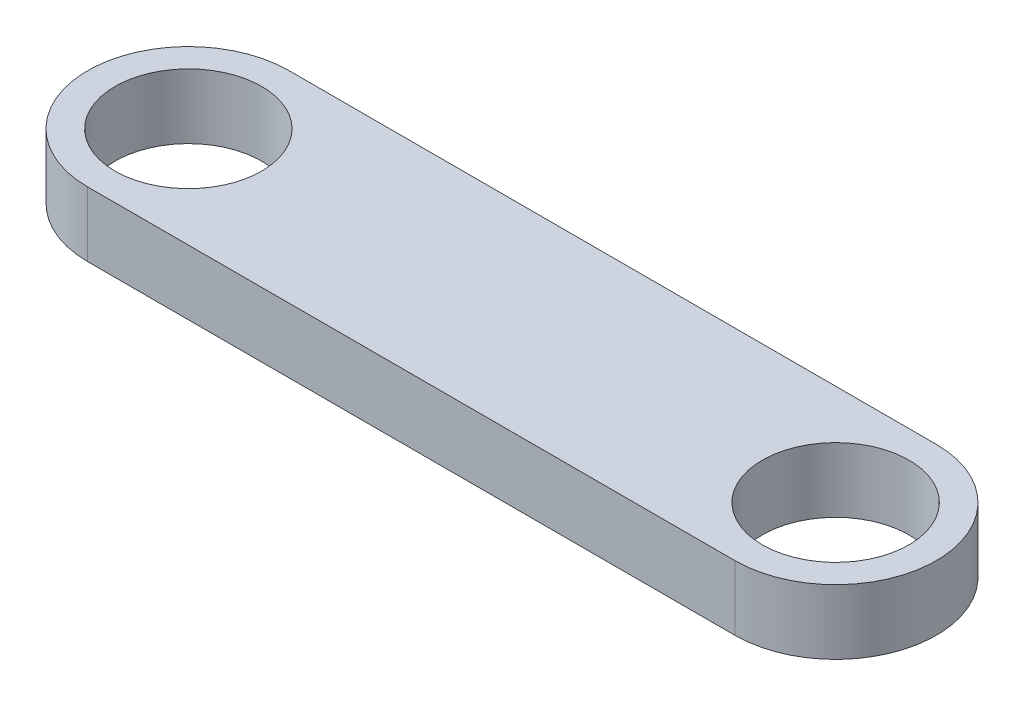
ISO-10303-21;
HEADER;
FILE_DESCRIPTION(('STEP AP214'),'2;1');
FILE_NAME('part.step','',(''),(''),'','','');
FILE_SCHEMA(('AUTOMOTIVE_DESIGN { 1 0 10303 214 1 1 1 1 }'));
ENDSEC;
DATA;
#1=APPLICATION_CONTEXT('core data for automotive mechanical design processes');
#2=APPLICATION_PROTOCOL_DEFINITION('international standard','automotive_design',2000,#1);
#3=PRODUCT_CONTEXT('',#1,'mechanical');
#4=PRODUCT('Part','Part','',(#3));
#5=PRODUCT_RELATED_PRODUCT_CATEGORY('part','',(#4));
#6=PRODUCT_DEFINITION_FORMATION('','',#4);
#7=PRODUCT_DEFINITION_CONTEXT('part definition',#1,'design');
#8=PRODUCT_DEFINITION('design','',#6,#7);
#9=PRODUCT_DEFINITION_SHAPE('','',#8);
#10=(LENGTH_UNIT() NAMED_UNIT(*) SI_UNIT(.MILLI.,.METRE.));
#11=(NAMED_UNIT(*) PLANE_ANGLE_UNIT() SI_UNIT($,.RADIAN.));
#12=(NAMED_UNIT(*) SI_UNIT($,.STERADIAN.) SOLID_ANGLE_UNIT());
#13=UNCERTAINTY_MEASURE_WITH_UNIT(LENGTH_MEASURE(1.E-05),#10,'distance_accuracy_value','');
#14=(GEOMETRIC_REPRESENTATION_CONTEXT(3) GLOBAL_UNCERTAINTY_ASSIGNED_CONTEXT((#13)) GLOBAL_UNIT_ASSIGNED_CONTEXT((#10,
#11,#12)) REPRESENTATION_CONTEXT('',''));
#15=CARTESIAN_POINT('',(0.,0.,0.));
#16=DIRECTION('',(0.,0.,1.));
#17=DIRECTION('',(1.,0.,0.));
#18=AXIS2_PLACEMENT_3D('',#15,#16,#17);
#19=CARTESIAN_POINT('',(22.5,4.5,0.));
#20=DIRECTION('',(0.,-1.,0.));
#21=DIRECTION('',(0.,0.,-1.));
#22=AXIS2_PLACEMENT_3D('',#19,#20,#21);
#23=CYLINDRICAL_SURFACE('',#22,7.);
#24=CARTESIAN_POINT('',(22.5,0.,0.));
#25=DIRECTION('',(0.,1.,0.));
#26=DIRECTION('',(0.,0.,1.));
#27=AXIS2_PLACEMENT_3D('',#24,#25,#26);
#28=CIRCLE('',#27,7.);
#29=CARTESIAN_POINT('',(22.5,0.,7.));
#30=VERTEX_POINT('',#29);
#31=CARTESIAN_POINT('',(22.5,0.,-7.));
#32=VERTEX_POINT('',#31);
#33=EDGE_CURVE('E111',#30,#32,#28,.T.);
#34=ORIENTED_EDGE('',*,*,#33,.T.);
#35=DIRECTION('',(0.,-1.,0.));
#36=VECTOR('',#35,1.);
#37=CARTESIAN_POINT('',(22.5,4.5,-7.));
#38=LINE('',#37,#36);
#39=CARTESIAN_POINT('',(22.5,4.5,-7.));
#40=VERTEX_POINT('',#39);
#41=EDGE_CURVE('E11',#40,#32,#38,.T.);
#42=ORIENTED_EDGE('',*,*,#41,.F.);
#43=CARTESIAN_POINT('',(22.5,4.5,0.));
#44=DIRECTION('',(0.,1.,0.));
#45=DIRECTION('',(0.,0.,1.));
#46=AXIS2_PLACEMENT_3D('',#43,#44,#45);
#47=CIRCLE('',#46,7.);
#48=CARTESIAN_POINT('',(22.5,4.5,7.));
#49=VERTEX_POINT('',#48);
#50=EDGE_CURVE('E82',#49,#40,#47,.T.);
#51=ORIENTED_EDGE('',*,*,#50,.F.);
#52=DIRECTION('',(0.,-1.,0.));
#53=VECTOR('',#52,1.);
#54=CARTESIAN_POINT('',(22.5,4.5,7.));
#55=LINE('',#54,#53);
#56=EDGE_CURVE('E110',#49,#30,#55,.T.);
#57=ORIENTED_EDGE('',*,*,#56,.T.);
#58=EDGE_LOOP('',(#34,#42,#51,#57));
#59=FACE_BOUND('',#58,.T.);
#60=ADVANCED_FACE('F40',(#59),#23,.T.);
#61=CARTESIAN_POINT('',(0.,4.5,-7.));
#62=DIRECTION('',(0.,0.,-1.));
#63=DIRECTION('',(-1.,0.,0.));
#64=AXIS2_PLACEMENT_3D('',#61,#62,#63);
#65=PLANE('',#64);
#66=DIRECTION('',(1.,0.,0.));
#67=VECTOR('',#66,1.);
#68=CARTESIAN_POINT('',(0.,0.,-7.));
#69=LINE('',#68,#67);
#70=CARTESIAN_POINT('',(-22.5,0.,-7.));
#71=VERTEX_POINT('',#70);
#72=EDGE_CURVE('E92',#71,#32,#69,.T.);
#73=ORIENTED_EDGE('',*,*,#72,.F.);
#74=DIRECTION('',(0.,-1.,0.));
#75=VECTOR('',#74,1.);
#76=CARTESIAN_POINT('',(-22.5,4.5,-7.));
#77=LINE('',#76,#75);
#78=CARTESIAN_POINT('',(-22.5,4.5,-7.));
#79=VERTEX_POINT('',#78);
#80=EDGE_CURVE('E48',#79,#71,#77,.T.);
#81=ORIENTED_EDGE('',*,*,#80,.F.);
#82=DIRECTION('',(1.,0.,0.));
#83=VECTOR('',#82,1.);
#84=CARTESIAN_POINT('',(0.,4.5,-7.));
#85=LINE('',#84,#83);
#86=EDGE_CURVE('E90',#79,#40,#85,.T.);
#87=ORIENTED_EDGE('',*,*,#86,.T.);
#88=ORIENTED_EDGE('',*,*,#41,.T.);
#89=EDGE_LOOP('',(#73,#81,#87,#88));
#90=FACE_BOUND('',#89,.T.);
#91=ADVANCED_FACE('F89',(#90),#65,.T.);
#92=CARTESIAN_POINT('',(-22.5,4.5,0.));
#93=DIRECTION('',(0.,-1.,0.));
#94=DIRECTION('',(0.,0.,-1.));
#95=AXIS2_PLACEMENT_3D('',#92,#93,#94);
#96=CYLINDRICAL_SURFACE('',#95,7.);
#97=CARTESIAN_POINT('',(-22.5,0.,0.));
#98=DIRECTION('',(0.,1.,0.));
#99=DIRECTION('',(0.,0.,1.));
#100=AXIS2_PLACEMENT_3D('',#97,#98,#99);
#101=CIRCLE('',#100,7.);
#102=CARTESIAN_POINT('',(-22.5,0.,7.));
#103=VERTEX_POINT('',#102);
#104=EDGE_CURVE('E71',#71,#103,#101,.T.);
#105=ORIENTED_EDGE('',*,*,#104,.T.);
#106=DIRECTION('',(0.,-1.,0.));
#107=VECTOR('',#106,1.);
#108=CARTESIAN_POINT('',(-22.5,4.5,7.));
#109=LINE('',#108,#107);
#110=CARTESIAN_POINT('',(-22.5,4.5,7.));
#111=VERTEX_POINT('',#110);
#112=EDGE_CURVE('E93',#111,#103,#109,.T.);
#113=ORIENTED_EDGE('',*,*,#112,.F.);
#114=CARTESIAN_POINT('',(-22.5,4.5,0.));
#115=DIRECTION('',(0.,1.,0.));
#116=DIRECTION('',(0.,0.,1.));
#117=AXIS2_PLACEMENT_3D('',#114,#115,#116);
#118=CIRCLE('',#117,7.);
#119=EDGE_CURVE('E94',#79,#111,#118,.T.);
#120=ORIENTED_EDGE('',*,*,#119,.F.);
#121=ORIENTED_EDGE('',*,*,#80,.T.);
#122=EDGE_LOOP('',(#105,#113,#120,#121));
#123=FACE_BOUND('',#122,.T.);
#124=ADVANCED_FACE('F95',(#123),#96,.T.);
#125=CARTESIAN_POINT('',(22.5,4.5,0.));
#126=DIRECTION('',(0.,-1.,0.));
#127=DIRECTION('',(0.,0.,-1.));
#128=AXIS2_PLACEMENT_3D('',#125,#126,#127);
#129=CYLINDRICAL_SURFACE('',#128,5.1);
#130=CARTESIAN_POINT('',(22.5,4.5,0.));
#131=DIRECTION('',(0.,1.,0.));
#132=DIRECTION('',(0.,0.,1.));
#133=AXIS2_PLACEMENT_3D('',#130,#131,#132);
#134=CIRCLE('',#133,5.1);
#135=CARTESIAN_POINT('',(22.5,4.5,5.10000000000001));
#136=VERTEX_POINT('',#135);
#137=EDGE_CURVE('E104',#136,#136,#134,.T.);
#138=ORIENTED_EDGE('',*,*,#137,.T.);
#139=EDGE_LOOP('',(#138));
#140=FACE_BOUND('',#139,.T.);
#141=CARTESIAN_POINT('',(22.5,0.,0.));
#142=DIRECTION('',(0.,1.,0.));
#143=DIRECTION('',(0.,0.,1.));
#144=AXIS2_PLACEMENT_3D('',#141,#142,#143);
#145=CIRCLE('',#144,5.1);
#146=CARTESIAN_POINT('',(22.5,0.,5.10000000000001));
#147=VERTEX_POINT('',#146);
#148=EDGE_CURVE('E117',#147,#147,#145,.T.);
#149=ORIENTED_EDGE('',*,*,#148,.F.);
#150=EDGE_LOOP('',(#149));
#151=FACE_BOUND('',#150,.T.);
#152=ADVANCED_FACE('F136',(#140,#151),#129,.F.);
#153=CARTESIAN_POINT('',(0.,4.5,7.));
#154=DIRECTION('',(0.,0.,-1.));
#155=DIRECTION('',(-1.,0.,0.));
#156=AXIS2_PLACEMENT_3D('',#153,#154,#155);
#157=PLANE('',#156);
#158=DIRECTION('',(1.,0.,0.));
#159=VECTOR('',#158,1.);
#160=CARTESIAN_POINT('',(0.,0.,7.));
#161=LINE('',#160,#159);
#162=EDGE_CURVE('E77',#103,#30,#161,.T.);
#163=ORIENTED_EDGE('',*,*,#162,.T.);
#164=ORIENTED_EDGE('',*,*,#56,.F.);
#165=DIRECTION('',(1.,0.,0.));
#166=VECTOR('',#165,1.);
#167=CARTESIAN_POINT('',(0.,4.5,7.));
#168=LINE('',#167,#166);
#169=EDGE_CURVE('E56',#111,#49,#168,.T.);
#170=ORIENTED_EDGE('',*,*,#169,.F.);
#171=ORIENTED_EDGE('',*,*,#112,.T.);
#172=EDGE_LOOP('',(#163,#164,#170,#171));
#173=FACE_BOUND('',#172,.T.);
#174=ADVANCED_FACE('F123',(#173),#157,.F.);
#175=CARTESIAN_POINT('',(-22.5,4.5,0.));
#176=DIRECTION('',(0.,-1.,0.));
#177=DIRECTION('',(0.,0.,-1.));
#178=AXIS2_PLACEMENT_3D('',#175,#176,#177);
#179=CYLINDRICAL_SURFACE('',#178,5.1);
#180=CARTESIAN_POINT('',(-22.5,4.5,0.));
#181=DIRECTION('',(0.,1.,0.));
#182=DIRECTION('',(0.,0.,1.));
#183=AXIS2_PLACEMENT_3D('',#180,#181,#182);
#184=CIRCLE('',#183,5.1);
#185=CARTESIAN_POINT('',(-22.5,4.5,5.1));
#186=VERTEX_POINT('',#185);
#187=EDGE_CURVE('E107',#186,#186,#184,.T.);
#188=ORIENTED_EDGE('',*,*,#187,.T.);
#189=EDGE_LOOP('',(#188));
#190=FACE_BOUND('',#189,.T.);
#191=CARTESIAN_POINT('',(-22.5,0.,0.));
#192=DIRECTION('',(0.,1.,0.));
#193=DIRECTION('',(0.,0.,1.));
#194=AXIS2_PLACEMENT_3D('',#191,#192,#193);
#195=CIRCLE('',#194,5.1);
#196=CARTESIAN_POINT('',(-22.5,0.,5.1));
#197=VERTEX_POINT('',#196);
#198=EDGE_CURVE('E100',#197,#197,#195,.T.);
#199=ORIENTED_EDGE('',*,*,#198,.F.);
#200=EDGE_LOOP('',(#199));
#201=FACE_BOUND('',#200,.T.);
#202=ADVANCED_FACE('F141',(#190,#201),#179,.F.);
#203=CARTESIAN_POINT('',(0.,4.5,0.));
#204=DIRECTION('',(0.,1.,0.));
#205=DIRECTION('',(0.,0.,1.));
#206=AXIS2_PLACEMENT_3D('',#203,#204,#205);
#207=PLANE('',#206);
#208=ORIENTED_EDGE('',*,*,#50,.T.);
#209=ORIENTED_EDGE('',*,*,#86,.F.);
#210=ORIENTED_EDGE('',*,*,#119,.T.);
#211=ORIENTED_EDGE('',*,*,#169,.T.);
#212=EDGE_LOOP('',(#208,#209,#210,#211));
#213=FACE_BOUND('',#212,.T.);
#214=ORIENTED_EDGE('',*,*,#137,.F.);
#215=EDGE_LOOP('',(#214));
#216=FACE_BOUND('',#215,.T.);
#217=ORIENTED_EDGE('',*,*,#187,.F.);
#218=EDGE_LOOP('',(#217));
#219=FACE_BOUND('',#218,.T.);
#220=ADVANCED_FACE('F97',(#213,#216,#219),#207,.T.);
#221=CARTESIAN_POINT('',(0.,0.,0.));
#222=DIRECTION('',(0.,1.,0.));
#223=DIRECTION('',(0.,0.,1.));
#224=AXIS2_PLACEMENT_3D('',#221,#222,#223);
#225=PLANE('',#224);
#226=ORIENTED_EDGE('',*,*,#33,.F.);
#227=ORIENTED_EDGE('',*,*,#162,.F.);
#228=ORIENTED_EDGE('',*,*,#104,.F.);
#229=ORIENTED_EDGE('',*,*,#72,.T.);
#230=EDGE_LOOP('',(#226,#227,#228,#229));
#231=FACE_BOUND('',#230,.T.);
#232=ORIENTED_EDGE('',*,*,#148,.T.);
#233=EDGE_LOOP('',(#232));
#234=FACE_BOUND('',#233,.T.);
#235=ORIENTED_EDGE('',*,*,#198,.T.);
#236=EDGE_LOOP('',(#235));
#237=FACE_BOUND('',#236,.T.);
#238=ADVANCED_FACE('F126',(#231,#234,#237),#225,.F.);
#239=CLOSED_SHELL('',(#60,#91,#124,#152,#174,#202,#220,#238));
#240=MANIFOLD_SOLID_BREP('B2',#239);
#241=ADVANCED_BREP_SHAPE_REPRESENTATION('',(#18,#240),#14);
#242=SHAPE_DEFINITION_REPRESENTATION(#9,#241);
ENDSEC;
END-ISO-10303-21;
